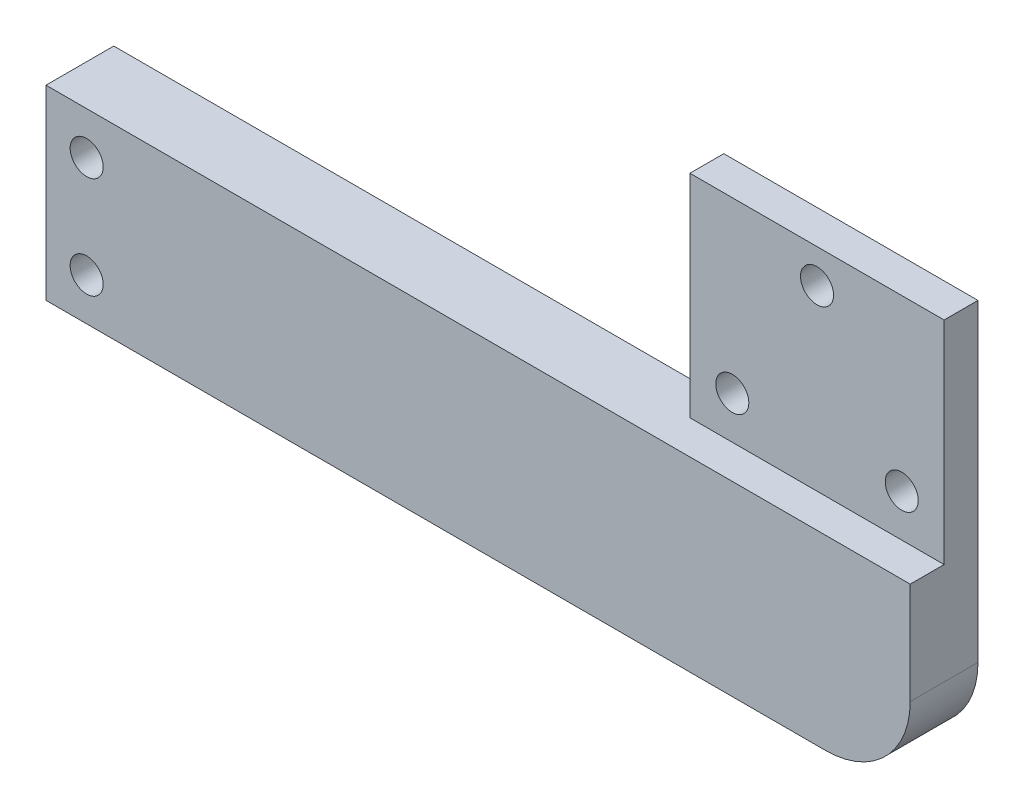
ISO-10303-21;
HEADER;
FILE_DESCRIPTION(('STEP AP214'),'2;1');
FILE_NAME('part.step','',(''),(''),'','','');
FILE_SCHEMA(('AUTOMOTIVE_DESIGN { 1 0 10303 214 1 1 1 1 }'));
ENDSEC;
DATA;
#1=APPLICATION_CONTEXT('core data for automotive mechanical design processes');
#2=APPLICATION_PROTOCOL_DEFINITION('international standard','automotive_design',2000,#1);
#3=PRODUCT_CONTEXT('',#1,'mechanical');
#4=PRODUCT('Part','Part','',(#3));
#5=PRODUCT_RELATED_PRODUCT_CATEGORY('part','',(#4));
#6=PRODUCT_DEFINITION_FORMATION('','',#4);
#7=PRODUCT_DEFINITION_CONTEXT('part definition',#1,'design');
#8=PRODUCT_DEFINITION('design','',#6,#7);
#9=PRODUCT_DEFINITION_SHAPE('','',#8);
#10=(LENGTH_UNIT() NAMED_UNIT(*) SI_UNIT(.MILLI.,.METRE.));
#11=(NAMED_UNIT(*) PLANE_ANGLE_UNIT() SI_UNIT($,.RADIAN.));
#12=(NAMED_UNIT(*) SI_UNIT($,.STERADIAN.) SOLID_ANGLE_UNIT());
#13=UNCERTAINTY_MEASURE_WITH_UNIT(LENGTH_MEASURE(1.E-05),#10,'distance_accuracy_value','');
#14=(GEOMETRIC_REPRESENTATION_CONTEXT(3) GLOBAL_UNCERTAINTY_ASSIGNED_CONTEXT((#13)) GLOBAL_UNIT_ASSIGNED_CONTEXT((#10,
#11,#12)) REPRESENTATION_CONTEXT('',''));
#15=CARTESIAN_POINT('',(0.,0.,0.));
#16=DIRECTION('',(0.,0.,1.));
#17=DIRECTION('',(1.,0.,0.));
#18=AXIS2_PLACEMENT_3D('',#15,#16,#17);
#19=CARTESIAN_POINT('',(-51.,11.,8.));
#20=DIRECTION('',(0.,-1.,0.));
#21=DIRECTION('',(-1.,0.,0.));
#22=AXIS2_PLACEMENT_3D('',#19,#20,#21);
#23=PLANE('',#22);
#24=DIRECTION('',(0.,0.,-1.));
#25=VECTOR('',#24,1.);
#26=CARTESIAN_POINT('',(21.,11.,8.));
#27=LINE('',#26,#25);
#28=CARTESIAN_POINT('',(21.,11.,4.));
#29=VERTEX_POINT('',#28);
#30=CARTESIAN_POINT('',(21.,11.,0.));
#31=VERTEX_POINT('',#30);
#32=EDGE_CURVE('E34',#29,#31,#27,.T.);
#33=ORIENTED_EDGE('',*,*,#32,.T.);
#34=DIRECTION('',(1.,0.,0.));
#35=VECTOR('',#34,1.);
#36=CARTESIAN_POINT('',(-51.,11.,0.));
#37=LINE('',#36,#35);
#38=CARTESIAN_POINT('',(-51.,11.,0.));
#39=VERTEX_POINT('',#38);
#40=EDGE_CURVE('E147',#39,#31,#37,.T.);
#41=ORIENTED_EDGE('',*,*,#40,.F.);
#42=DIRECTION('',(0.,0.,-1.));
#43=VECTOR('',#42,1.);
#44=CARTESIAN_POINT('',(-51.,11.,8.));
#45=LINE('',#44,#43);
#46=CARTESIAN_POINT('',(-51.,11.,8.));
#47=VERTEX_POINT('',#46);
#48=EDGE_CURVE('E159',#47,#39,#45,.T.);
#49=ORIENTED_EDGE('',*,*,#48,.F.);
#50=DIRECTION('',(1.,0.,0.));
#51=VECTOR('',#50,1.);
#52=CARTESIAN_POINT('',(-51.,11.,8.));
#53=LINE('',#52,#51);
#54=CARTESIAN_POINT('',(51.,11.,8.));
#55=VERTEX_POINT('',#54);
#56=EDGE_CURVE('E137',#47,#55,#53,.T.);
#57=ORIENTED_EDGE('',*,*,#56,.T.);
#58=DIRECTION('',(0.,0.,1.));
#59=VECTOR('',#58,1.);
#60=CARTESIAN_POINT('',(51.,11.,4.));
#61=LINE('',#60,#59);
#62=CARTESIAN_POINT('',(51.,11.,4.));
#63=VERTEX_POINT('',#62);
#64=EDGE_CURVE('E173',#63,#55,#61,.T.);
#65=ORIENTED_EDGE('',*,*,#64,.F.);
#66=DIRECTION('',(-1.,0.,0.));
#67=VECTOR('',#66,1.);
#68=CARTESIAN_POINT('',(21.,11.,4.));
#69=LINE('',#68,#67);
#70=EDGE_CURVE('E109',#63,#29,#69,.T.);
#71=ORIENTED_EDGE('',*,*,#70,.T.);
#72=EDGE_LOOP('',(#33,#41,#49,#57,#65,#71));
#73=FACE_BOUND('',#72,.T.);
#74=ADVANCED_FACE('F30',(#73),#23,.F.);
#75=CARTESIAN_POINT('',(-51.,11.,8.));
#76=DIRECTION('',(1.,0.,0.));
#77=DIRECTION('',(0.,0.,1.));
#78=AXIS2_PLACEMENT_3D('',#75,#76,#77);
#79=PLANE('',#78);
#80=DIRECTION('',(0.,1.,0.));
#81=VECTOR('',#80,1.);
#82=CARTESIAN_POINT('',(-51.,11.,0.));
#83=LINE('',#82,#81);
#84=CARTESIAN_POINT('',(-51.,-11.,0.));
#85=VERTEX_POINT('',#84);
#86=EDGE_CURVE('E207',#85,#39,#83,.T.);
#87=ORIENTED_EDGE('',*,*,#86,.F.);
#88=DIRECTION('',(0.,0.,-1.));
#89=VECTOR('',#88,1.);
#90=CARTESIAN_POINT('',(-51.,-11.,8.));
#91=LINE('',#90,#89);
#92=CARTESIAN_POINT('',(-51.,-11.,8.));
#93=VERTEX_POINT('',#92);
#94=EDGE_CURVE('E213',#93,#85,#91,.T.);
#95=ORIENTED_EDGE('',*,*,#94,.F.);
#96=DIRECTION('',(0.,1.,0.));
#97=VECTOR('',#96,1.);
#98=CARTESIAN_POINT('',(-51.,11.,8.));
#99=LINE('',#98,#97);
#100=EDGE_CURVE('E135',#93,#47,#99,.T.);
#101=ORIENTED_EDGE('',*,*,#100,.T.);
#102=ORIENTED_EDGE('',*,*,#48,.T.);
#103=EDGE_LOOP('',(#87,#95,#101,#102));
#104=FACE_BOUND('',#103,.T.);
#105=ADVANCED_FACE('F219',(#104),#79,.F.);
#106=CARTESIAN_POINT('',(51.,11.,8.));
#107=DIRECTION('',(-1.,0.,0.));
#108=DIRECTION('',(0.,0.,-1.));
#109=AXIS2_PLACEMENT_3D('',#106,#107,#108);
#110=PLANE('',#109);
#111=DIRECTION('',(0.,-1.,0.));
#112=VECTOR('',#111,1.);
#113=CARTESIAN_POINT('',(51.,11.,8.));
#114=LINE('',#113,#112);
#115=CARTESIAN_POINT('',(51.,-1.,8.));
#116=VERTEX_POINT('',#115);
#117=EDGE_CURVE('E141',#55,#116,#114,.T.);
#118=ORIENTED_EDGE('',*,*,#117,.T.);
#119=DIRECTION('',(0.,0.,-1.));
#120=VECTOR('',#119,1.);
#121=CARTESIAN_POINT('',(51.,-1.,8.));
#122=LINE('',#121,#120);
#123=CARTESIAN_POINT('',(51.,-1.,0.));
#124=VERTEX_POINT('',#123);
#125=EDGE_CURVE('E40',#124,#116,#122,.F.);
#126=ORIENTED_EDGE('',*,*,#125,.F.);
#127=DIRECTION('',(0.,-1.,0.));
#128=VECTOR('',#127,1.);
#129=CARTESIAN_POINT('',(51.,11.,0.));
#130=LINE('',#129,#128);
#131=CARTESIAN_POINT('',(51.,36.,0.));
#132=VERTEX_POINT('',#131);
#133=EDGE_CURVE('E118',#132,#124,#130,.T.);
#134=ORIENTED_EDGE('',*,*,#133,.F.);
#135=DIRECTION('',(0.,0.,-1.));
#136=VECTOR('',#135,1.);
#137=CARTESIAN_POINT('',(51.,36.,8.));
#138=LINE('',#137,#136);
#139=CARTESIAN_POINT('',(51.,36.,4.));
#140=VERTEX_POINT('',#139);
#141=EDGE_CURVE('E99',#140,#132,#138,.T.);
#142=ORIENTED_EDGE('',*,*,#141,.F.);
#143=DIRECTION('',(0.,-1.,0.));
#144=VECTOR('',#143,1.);
#145=CARTESIAN_POINT('',(51.,36.,4.));
#146=LINE('',#145,#144);
#147=EDGE_CURVE('E102',#140,#63,#146,.T.);
#148=ORIENTED_EDGE('',*,*,#147,.T.);
#149=ORIENTED_EDGE('',*,*,#64,.T.);
#150=EDGE_LOOP('',(#118,#126,#134,#142,#148,#149));
#151=FACE_BOUND('',#150,.T.);
#152=ADVANCED_FACE('F115',(#151),#110,.F.);
#153=CARTESIAN_POINT('',(-51.,-11.,8.));
#154=DIRECTION('',(0.,1.,0.));
#155=DIRECTION('',(1.,0.,0.));
#156=AXIS2_PLACEMENT_3D('',#153,#154,#155);
#157=PLANE('',#156);
#158=DIRECTION('',(-1.,0.,0.));
#159=VECTOR('',#158,1.);
#160=CARTESIAN_POINT('',(-51.,-11.,8.));
#161=LINE('',#160,#159);
#162=CARTESIAN_POINT('',(41.,-11.,8.));
#163=VERTEX_POINT('',#162);
#164=EDGE_CURVE('E215',#163,#93,#161,.T.);
#165=ORIENTED_EDGE('',*,*,#164,.T.);
#166=ORIENTED_EDGE('',*,*,#94,.T.);
#167=DIRECTION('',(-1.,0.,0.));
#168=VECTOR('',#167,1.);
#169=CARTESIAN_POINT('',(-51.,-11.,0.));
#170=LINE('',#169,#168);
#171=CARTESIAN_POINT('',(41.,-11.,0.));
#172=VERTEX_POINT('',#171);
#173=EDGE_CURVE('E138',#172,#85,#170,.T.);
#174=ORIENTED_EDGE('',*,*,#173,.F.);
#175=DIRECTION('',(0.,0.,-1.));
#176=VECTOR('',#175,1.);
#177=CARTESIAN_POINT('',(41.,-11.,8.));
#178=LINE('',#177,#176);
#179=EDGE_CURVE('E155',#163,#172,#178,.T.);
#180=ORIENTED_EDGE('',*,*,#179,.F.);
#181=EDGE_LOOP('',(#165,#166,#174,#180));
#182=FACE_BOUND('',#181,.T.);
#183=ADVANCED_FACE('F214',(#182),#157,.F.);
#184=CARTESIAN_POINT('',(-51.,-11.,8.));
#185=DIRECTION('',(0.,0.,-1.));
#186=DIRECTION('',(1.,0.,0.));
#187=AXIS2_PLACEMENT_3D('',#184,#185,#186);
#188=PLANE('',#187);
#189=CARTESIAN_POINT('',(-46.2,6.,8.));
#190=DIRECTION('',(0.,0.,-1.));
#191=DIRECTION('',(-1.,0.,0.));
#192=AXIS2_PLACEMENT_3D('',#189,#190,#191);
#193=CIRCLE('',#192,1.94999999999999);
#194=CARTESIAN_POINT('',(-48.15,6.,8.));
#195=VERTEX_POINT('',#194);
#196=EDGE_CURVE('E127',#195,#195,#193,.T.);
#197=ORIENTED_EDGE('',*,*,#196,.T.);
#198=EDGE_LOOP('',(#197));
#199=FACE_BOUND('',#198,.T.);
#200=CARTESIAN_POINT('',(-46.2,-6.,8.));
#201=DIRECTION('',(0.,0.,-1.));
#202=DIRECTION('',(-1.,0.,0.));
#203=AXIS2_PLACEMENT_3D('',#200,#201,#202);
#204=CIRCLE('',#203,1.94999999999999);
#205=CARTESIAN_POINT('',(-48.15,-6.,8.));
#206=VERTEX_POINT('',#205);
#207=EDGE_CURVE('E131',#206,#206,#204,.T.);
#208=ORIENTED_EDGE('',*,*,#207,.T.);
#209=EDGE_LOOP('',(#208));
#210=FACE_BOUND('',#209,.T.);
#211=ORIENTED_EDGE('',*,*,#56,.F.);
#212=ORIENTED_EDGE('',*,*,#100,.F.);
#213=ORIENTED_EDGE('',*,*,#164,.F.);
#214=CARTESIAN_POINT('',(41.,-1.00000000000001,8.));
#215=DIRECTION('',(0.,0.,1.));
#216=DIRECTION('',(1.,0.,0.));
#217=AXIS2_PLACEMENT_3D('',#214,#215,#216);
#218=CIRCLE('',#217,10.);
#219=EDGE_CURVE('E11',#116,#163,#218,.F.);
#220=ORIENTED_EDGE('',*,*,#219,.F.);
#221=ORIENTED_EDGE('',*,*,#117,.F.);
#222=EDGE_LOOP('',(#211,#212,#213,#220,#221));
#223=FACE_BOUND('',#222,.T.);
#224=ADVANCED_FACE('F194',(#199,#210,#223),#188,.F.);
#225=CARTESIAN_POINT('',(-51.,-11.,0.));
#226=DIRECTION('',(0.,0.,-1.));
#227=DIRECTION('',(1.,0.,0.));
#228=AXIS2_PLACEMENT_3D('',#225,#226,#227);
#229=PLANE('',#228);
#230=CARTESIAN_POINT('',(46.,16.,0.));
#231=DIRECTION('',(0.,0.,1.));
#232=DIRECTION('',(1.,0.,0.));
#233=AXIS2_PLACEMENT_3D('',#230,#231,#232);
#234=CIRCLE('',#233,1.94999999999999);
#235=CARTESIAN_POINT('',(47.95,16.,0.));
#236=VERTEX_POINT('',#235);
#237=EDGE_CURVE('E167',#236,#236,#234,.T.);
#238=ORIENTED_EDGE('',*,*,#237,.T.);
#239=EDGE_LOOP('',(#238));
#240=FACE_BOUND('',#239,.T.);
#241=CARTESIAN_POINT('',(26.,16.,0.));
#242=DIRECTION('',(0.,0.,1.));
#243=DIRECTION('',(1.,0.,0.));
#244=AXIS2_PLACEMENT_3D('',#241,#242,#243);
#245=CIRCLE('',#244,1.94999999999999);
#246=CARTESIAN_POINT('',(27.95,16.,0.));
#247=VERTEX_POINT('',#246);
#248=EDGE_CURVE('E164',#247,#247,#245,.T.);
#249=ORIENTED_EDGE('',*,*,#248,.T.);
#250=EDGE_LOOP('',(#249));
#251=FACE_BOUND('',#250,.T.);
#252=CARTESIAN_POINT('',(36.,32.,0.));
#253=DIRECTION('',(0.,0.,1.));
#254=DIRECTION('',(1.,0.,0.));
#255=AXIS2_PLACEMENT_3D('',#252,#253,#254);
#256=CIRCLE('',#255,1.94999999999999);
#257=CARTESIAN_POINT('',(37.95,32.,0.));
#258=VERTEX_POINT('',#257);
#259=EDGE_CURVE('E152',#258,#258,#256,.T.);
#260=ORIENTED_EDGE('',*,*,#259,.T.);
#261=EDGE_LOOP('',(#260));
#262=FACE_BOUND('',#261,.T.);
#263=CARTESIAN_POINT('',(-46.2,6.,0.));
#264=DIRECTION('',(0.,0.,1.));
#265=DIRECTION('',(1.,0.,0.));
#266=AXIS2_PLACEMENT_3D('',#263,#264,#265);
#267=CIRCLE('',#266,1.94999999999999);
#268=CARTESIAN_POINT('',(-44.25,6.,0.));
#269=VERTEX_POINT('',#268);
#270=EDGE_CURVE('E130',#269,#269,#267,.T.);
#271=ORIENTED_EDGE('',*,*,#270,.T.);
#272=EDGE_LOOP('',(#271));
#273=FACE_BOUND('',#272,.T.);
#274=CARTESIAN_POINT('',(-46.2,-6.,0.));
#275=DIRECTION('',(0.,0.,1.));
#276=DIRECTION('',(1.,0.,0.));
#277=AXIS2_PLACEMENT_3D('',#274,#275,#276);
#278=CIRCLE('',#277,1.94999999999999);
#279=CARTESIAN_POINT('',(-44.25,-6.,0.));
#280=VERTEX_POINT('',#279);
#281=EDGE_CURVE('E134',#280,#280,#278,.T.);
#282=ORIENTED_EDGE('',*,*,#281,.T.);
#283=EDGE_LOOP('',(#282));
#284=FACE_BOUND('',#283,.T.);
#285=ORIENTED_EDGE('',*,*,#173,.T.);
#286=ORIENTED_EDGE('',*,*,#86,.T.);
#287=ORIENTED_EDGE('',*,*,#40,.T.);
#288=DIRECTION('',(0.,1.,0.));
#289=VECTOR('',#288,1.);
#290=CARTESIAN_POINT('',(21.,11.,0.));
#291=LINE('',#290,#289);
#292=CARTESIAN_POINT('',(21.,36.,0.));
#293=VERTEX_POINT('',#292);
#294=EDGE_CURVE('E122',#31,#293,#291,.T.);
#295=ORIENTED_EDGE('',*,*,#294,.T.);
#296=DIRECTION('',(1.,0.,0.));
#297=VECTOR('',#296,1.);
#298=CARTESIAN_POINT('',(51.,36.,0.));
#299=LINE('',#298,#297);
#300=EDGE_CURVE('E119',#293,#132,#299,.T.);
#301=ORIENTED_EDGE('',*,*,#300,.T.);
#302=ORIENTED_EDGE('',*,*,#133,.T.);
#303=CARTESIAN_POINT('',(41.,-1.00000000000001,0.));
#304=DIRECTION('',(0.,0.,1.));
#305=DIRECTION('',(1.,0.,0.));
#306=AXIS2_PLACEMENT_3D('',#303,#304,#305);
#307=CIRCLE('',#306,10.);
#308=EDGE_CURVE('E158',#172,#124,#307,.T.);
#309=ORIENTED_EDGE('',*,*,#308,.F.);
#310=EDGE_LOOP('',(#285,#286,#287,#295,#301,#302,#309));
#311=FACE_BOUND('',#310,.T.);
#312=ADVANCED_FACE('F190',(#240,#251,#262,#273,#284,#311),#229,.T.);
#313=CARTESIAN_POINT('',(-46.2,-6.,8.));
#314=DIRECTION('',(0.,0.,1.));
#315=DIRECTION('',(-1.,0.,0.));
#316=AXIS2_PLACEMENT_3D('',#313,#314,#315);
#317=CYLINDRICAL_SURFACE('',#316,1.94999999999999);
#318=ORIENTED_EDGE('',*,*,#281,.F.);
#319=EDGE_LOOP('',(#318));
#320=FACE_BOUND('',#319,.T.);
#321=ORIENTED_EDGE('',*,*,#207,.F.);
#322=EDGE_LOOP('',(#321));
#323=FACE_BOUND('',#322,.T.);
#324=ADVANCED_FACE('F193',(#320,#323),#317,.F.);
#325=CARTESIAN_POINT('',(-46.2,6.,8.));
#326=DIRECTION('',(0.,0.,1.));
#327=DIRECTION('',(-1.,0.,0.));
#328=AXIS2_PLACEMENT_3D('',#325,#326,#327);
#329=CYLINDRICAL_SURFACE('',#328,1.94999999999999);
#330=ORIENTED_EDGE('',*,*,#270,.F.);
#331=EDGE_LOOP('',(#330));
#332=FACE_BOUND('',#331,.T.);
#333=ORIENTED_EDGE('',*,*,#196,.F.);
#334=EDGE_LOOP('',(#333));
#335=FACE_BOUND('',#334,.T.);
#336=ADVANCED_FACE('F236',(#332,#335),#329,.F.);
#337=CARTESIAN_POINT('',(21.,11.,8.));
#338=DIRECTION('',(1.,0.,0.));
#339=DIRECTION('',(0.,0.,1.));
#340=AXIS2_PLACEMENT_3D('',#337,#338,#339);
#341=PLANE('',#340);
#342=DIRECTION('',(0.,0.,-1.));
#343=VECTOR('',#342,1.);
#344=CARTESIAN_POINT('',(21.,36.,8.));
#345=LINE('',#344,#343);
#346=CARTESIAN_POINT('',(21.,36.,4.));
#347=VERTEX_POINT('',#346);
#348=EDGE_CURVE('E101',#347,#293,#345,.T.);
#349=ORIENTED_EDGE('',*,*,#348,.T.);
#350=ORIENTED_EDGE('',*,*,#294,.F.);
#351=ORIENTED_EDGE('',*,*,#32,.F.);
#352=DIRECTION('',(0.,1.,0.));
#353=VECTOR('',#352,1.);
#354=CARTESIAN_POINT('',(21.,36.,4.));
#355=LINE('',#354,#353);
#356=EDGE_CURVE('E103',#29,#347,#355,.T.);
#357=ORIENTED_EDGE('',*,*,#356,.T.);
#358=EDGE_LOOP('',(#349,#350,#351,#357));
#359=FACE_BOUND('',#358,.T.);
#360=ADVANCED_FACE('F233',(#359),#341,.F.);
#361=CARTESIAN_POINT('',(51.,36.,8.));
#362=DIRECTION('',(0.,-1.,0.));
#363=DIRECTION('',(0.,0.,-1.));
#364=AXIS2_PLACEMENT_3D('',#361,#362,#363);
#365=PLANE('',#364);
#366=ORIENTED_EDGE('',*,*,#141,.T.);
#367=ORIENTED_EDGE('',*,*,#300,.F.);
#368=ORIENTED_EDGE('',*,*,#348,.F.);
#369=DIRECTION('',(1.,0.,0.));
#370=VECTOR('',#369,1.);
#371=CARTESIAN_POINT('',(21.,36.,4.));
#372=LINE('',#371,#370);
#373=EDGE_CURVE('E48',#347,#140,#372,.T.);
#374=ORIENTED_EDGE('',*,*,#373,.T.);
#375=EDGE_LOOP('',(#366,#367,#368,#374));
#376=FACE_BOUND('',#375,.T.);
#377=ADVANCED_FACE('F96',(#376),#365,.F.);
#378=CARTESIAN_POINT('',(41.,-1.00000000000001,8.));
#379=DIRECTION('',(0.,0.,-1.));
#380=DIRECTION('',(1.,0.,0.));
#381=AXIS2_PLACEMENT_3D('',#378,#379,#380);
#382=CYLINDRICAL_SURFACE('',#381,10.);
#383=ORIENTED_EDGE('',*,*,#219,.T.);
#384=ORIENTED_EDGE('',*,*,#179,.T.);
#385=ORIENTED_EDGE('',*,*,#308,.T.);
#386=ORIENTED_EDGE('',*,*,#125,.T.);
#387=EDGE_LOOP('',(#383,#384,#385,#386));
#388=FACE_BOUND('',#387,.T.);
#389=ADVANCED_FACE('F32',(#388),#382,.T.);
#390=CARTESIAN_POINT('',(36.,32.,8.));
#391=DIRECTION('',(0.,0.,1.));
#392=DIRECTION('',(-1.,0.,0.));
#393=AXIS2_PLACEMENT_3D('',#390,#391,#392);
#394=CYLINDRICAL_SURFACE('',#393,1.94999999999999);
#395=CARTESIAN_POINT('',(36.,32.,4.));
#396=DIRECTION('',(0.,0.,1.));
#397=DIRECTION('',(1.,0.,0.));
#398=AXIS2_PLACEMENT_3D('',#395,#396,#397);
#399=CIRCLE('',#398,1.94999999999999);
#400=CARTESIAN_POINT('',(37.95,32.,4.));
#401=VERTEX_POINT('',#400);
#402=EDGE_CURVE('E169',#401,#401,#399,.F.);
#403=ORIENTED_EDGE('',*,*,#402,.F.);
#404=EDGE_LOOP('',(#403));
#405=FACE_BOUND('',#404,.T.);
#406=ORIENTED_EDGE('',*,*,#259,.F.);
#407=EDGE_LOOP('',(#406));
#408=FACE_BOUND('',#407,.T.);
#409=ADVANCED_FACE('F183',(#405,#408),#394,.F.);
#410=CARTESIAN_POINT('',(26.,16.,8.));
#411=DIRECTION('',(0.,0.,1.));
#412=DIRECTION('',(-1.,0.,0.));
#413=AXIS2_PLACEMENT_3D('',#410,#411,#412);
#414=CYLINDRICAL_SURFACE('',#413,1.94999999999999);
#415=CARTESIAN_POINT('',(26.,16.,4.));
#416=DIRECTION('',(0.,0.,1.));
#417=DIRECTION('',(1.,0.,0.));
#418=AXIS2_PLACEMENT_3D('',#415,#416,#417);
#419=CIRCLE('',#418,1.94999999999999);
#420=CARTESIAN_POINT('',(27.95,16.,4.));
#421=VERTEX_POINT('',#420);
#422=EDGE_CURVE('E172',#421,#421,#419,.F.);
#423=ORIENTED_EDGE('',*,*,#422,.F.);
#424=EDGE_LOOP('',(#423));
#425=FACE_BOUND('',#424,.T.);
#426=ORIENTED_EDGE('',*,*,#248,.F.);
#427=EDGE_LOOP('',(#426));
#428=FACE_BOUND('',#427,.T.);
#429=ADVANCED_FACE('F186',(#425,#428),#414,.F.);
#430=CARTESIAN_POINT('',(46.,16.,8.));
#431=DIRECTION('',(0.,0.,1.));
#432=DIRECTION('',(-1.,0.,0.));
#433=AXIS2_PLACEMENT_3D('',#430,#431,#432);
#434=CYLINDRICAL_SURFACE('',#433,1.94999999999999);
#435=CARTESIAN_POINT('',(46.,16.,4.));
#436=DIRECTION('',(0.,0.,1.));
#437=DIRECTION('',(1.,0.,0.));
#438=AXIS2_PLACEMENT_3D('',#435,#436,#437);
#439=CIRCLE('',#438,1.94999999999999);
#440=CARTESIAN_POINT('',(47.95,16.,4.));
#441=VERTEX_POINT('',#440);
#442=EDGE_CURVE('E170',#441,#441,#439,.F.);
#443=ORIENTED_EDGE('',*,*,#442,.F.);
#444=EDGE_LOOP('',(#443));
#445=FACE_BOUND('',#444,.T.);
#446=ORIENTED_EDGE('',*,*,#237,.F.);
#447=EDGE_LOOP('',(#446));
#448=FACE_BOUND('',#447,.T.);
#449=ADVANCED_FACE('F303',(#445,#448),#434,.F.);
#450=CARTESIAN_POINT('',(21.,11.,4.));
#451=DIRECTION('',(0.,0.,-1.));
#452=DIRECTION('',(1.,0.,0.));
#453=AXIS2_PLACEMENT_3D('',#450,#451,#452);
#454=PLANE('',#453);
#455=ORIENTED_EDGE('',*,*,#422,.T.);
#456=EDGE_LOOP('',(#455));
#457=FACE_BOUND('',#456,.T.);
#458=ORIENTED_EDGE('',*,*,#356,.F.);
#459=ORIENTED_EDGE('',*,*,#70,.F.);
#460=ORIENTED_EDGE('',*,*,#147,.F.);
#461=ORIENTED_EDGE('',*,*,#373,.F.);
#462=EDGE_LOOP('',(#458,#459,#460,#461));
#463=FACE_BOUND('',#462,.T.);
#464=ORIENTED_EDGE('',*,*,#442,.T.);
#465=EDGE_LOOP('',(#464));
#466=FACE_BOUND('',#465,.T.);
#467=ORIENTED_EDGE('',*,*,#402,.T.);
#468=EDGE_LOOP('',(#467));
#469=FACE_BOUND('',#468,.T.);
#470=ADVANCED_FACE('F106',(#457,#463,#466,#469),#454,.F.);
#471=CLOSED_SHELL('',(#74,#105,#152,#183,#224,#312,#324,#336,#360,#377,#389,#409,#429,#449,#470));
#472=MANIFOLD_SOLID_BREP('B2',#471);
#473=ADVANCED_BREP_SHAPE_REPRESENTATION('',(#18,#472),#14);
#474=SHAPE_DEFINITION_REPRESENTATION(#9,#473);
ENDSEC;
END-ISO-10303-21;
